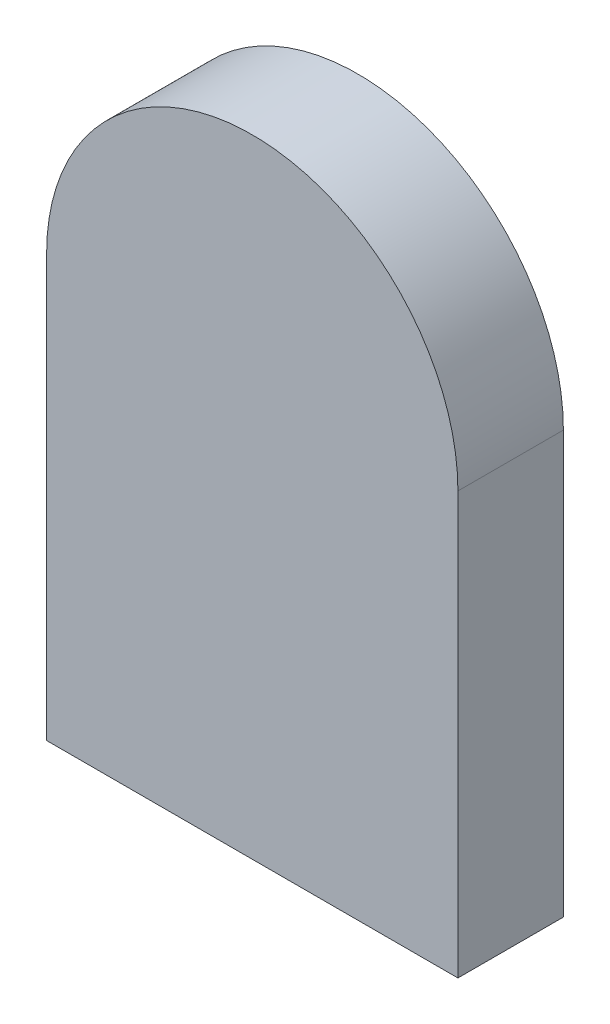
ISO-10303-21;
HEADER;
FILE_DESCRIPTION(('STEP AP214'),'2;1');
FILE_NAME('part.step','',(''),(''),'','','');
FILE_SCHEMA(('AUTOMOTIVE_DESIGN { 1 0 10303 214 1 1 1 1 }'));
ENDSEC;
DATA;
#1=APPLICATION_CONTEXT('core data for automotive mechanical design processes');
#2=APPLICATION_PROTOCOL_DEFINITION('international standard','automotive_design',2000,#1);
#3=PRODUCT_CONTEXT('',#1,'mechanical');
#4=PRODUCT('Part','Part','',(#3));
#5=PRODUCT_RELATED_PRODUCT_CATEGORY('part','',(#4));
#6=PRODUCT_DEFINITION_FORMATION('','',#4);
#7=PRODUCT_DEFINITION_CONTEXT('part definition',#1,'design');
#8=PRODUCT_DEFINITION('design','',#6,#7);
#9=PRODUCT_DEFINITION_SHAPE('','',#8);
#10=(LENGTH_UNIT() NAMED_UNIT(*) SI_UNIT(.MILLI.,.METRE.));
#11=(NAMED_UNIT(*) PLANE_ANGLE_UNIT() SI_UNIT($,.RADIAN.));
#12=(NAMED_UNIT(*) SI_UNIT($,.STERADIAN.) SOLID_ANGLE_UNIT());
#13=UNCERTAINTY_MEASURE_WITH_UNIT(LENGTH_MEASURE(1.E-05),#10,'distance_accuracy_value','');
#14=(GEOMETRIC_REPRESENTATION_CONTEXT(3) GLOBAL_UNCERTAINTY_ASSIGNED_CONTEXT((#13)) GLOBAL_UNIT_ASSIGNED_CONTEXT((#10,
#11,#12)) REPRESENTATION_CONTEXT('',''));
#15=CARTESIAN_POINT('',(0.,0.,0.));
#16=DIRECTION('',(0.,0.,1.));
#17=DIRECTION('',(1.,0.,0.));
#18=AXIS2_PLACEMENT_3D('',#15,#16,#17);
#19=CARTESIAN_POINT('',(-77.3435890798283,-6.81318919388909,1.));
#20=DIRECTION('',(-1.,0.,0.));
#21=DIRECTION('',(0.,0.,1.));
#22=AXIS2_PLACEMENT_3D('',#19,#20,#21);
#23=PLANE('',#22);
#24=DIRECTION('',(0.,1.,0.));
#25=VECTOR('',#24,1.);
#26=CARTESIAN_POINT('',(-77.3435890798283,-6.81318919388909,0.));
#27=LINE('',#26,#25);
#28=CARTESIAN_POINT('',(-77.3435890798283,-7.81318919388909,0.));
#29=VERTEX_POINT('',#28);
#30=CARTESIAN_POINT('',(-77.3435890798283,0.186810806110911,0.));
#31=VERTEX_POINT('',#30);
#32=EDGE_CURVE('E88',#29,#31,#27,.T.);
#33=ORIENTED_EDGE('',*,*,#32,.T.);
#34=DIRECTION('',(0.,0.,-1.));
#35=VECTOR('',#34,1.);
#36=CARTESIAN_POINT('',(-77.3435890798283,0.186810806110911,1.));
#37=LINE('',#36,#35);
#38=CARTESIAN_POINT('',(-77.3435890798283,0.186810806110911,1.));
#39=VERTEX_POINT('',#38);
#40=EDGE_CURVE('E11',#39,#31,#37,.T.);
#41=ORIENTED_EDGE('',*,*,#40,.F.);
#42=DIRECTION('',(0.,1.,0.));
#43=VECTOR('',#42,1.);
#44=CARTESIAN_POINT('',(-77.3435890798283,-6.81318919388909,1.));
#45=LINE('',#44,#43);
#46=CARTESIAN_POINT('',(-77.3435890798283,-7.81318919388909,1.));
#47=VERTEX_POINT('',#46);
#48=EDGE_CURVE('E145',#47,#39,#45,.T.);
#49=ORIENTED_EDGE('',*,*,#48,.F.);
#50=DIRECTION('',(0.,0.,-1.));
#51=VECTOR('',#50,1.);
#52=CARTESIAN_POINT('',(-77.3435890798283,-7.81318919388909,1.));
#53=LINE('',#52,#51);
#54=EDGE_CURVE('E51',#47,#29,#53,.T.);
#55=ORIENTED_EDGE('',*,*,#54,.T.);
#56=EDGE_LOOP('',(#33,#41,#49,#55));
#57=FACE_BOUND('',#56,.T.);
#58=ADVANCED_FACE('F33',(#57),#23,.F.);
#59=CARTESIAN_POINT('',(-74.4435890798283,0.186810806110911,1.));
#60=DIRECTION('',(0.,0.,-1.));
#61=DIRECTION('',(-1.,0.,0.));
#62=AXIS2_PLACEMENT_3D('',#59,#60,#61);
#63=CYLINDRICAL_SURFACE('',#62,2.89999999999999);
#64=CARTESIAN_POINT('',(-74.4435890798283,0.186810806110911,0.));
#65=DIRECTION('',(0.,0.,-1.));
#66=DIRECTION('',(-1.,0.,0.));
#67=AXIS2_PLACEMENT_3D('',#64,#65,#66);
#68=CIRCLE('',#67,2.89999999999999);
#69=CARTESIAN_POINT('',(-71.5435890798283,0.186810806110911,0.));
#70=VERTEX_POINT('',#69);
#71=EDGE_CURVE('E181',#31,#70,#68,.T.);
#72=ORIENTED_EDGE('',*,*,#71,.T.);
#73=DIRECTION('',(0.,0.,-1.));
#74=VECTOR('',#73,1.);
#75=CARTESIAN_POINT('',(-71.5435890798283,0.186810806110911,1.));
#76=LINE('',#75,#74);
#77=CARTESIAN_POINT('',(-71.5435890798283,0.186810806110911,1.));
#78=VERTEX_POINT('',#77);
#79=EDGE_CURVE('E42',#78,#70,#76,.T.);
#80=ORIENTED_EDGE('',*,*,#79,.F.);
#81=CARTESIAN_POINT('',(-74.4435890798283,0.186810806110911,1.));
#82=DIRECTION('',(0.,0.,-1.));
#83=DIRECTION('',(-1.,0.,0.));
#84=AXIS2_PLACEMENT_3D('',#81,#82,#83);
#85=CIRCLE('',#84,2.89999999999999);
#86=EDGE_CURVE('E141',#39,#78,#85,.T.);
#87=ORIENTED_EDGE('',*,*,#86,.F.);
#88=ORIENTED_EDGE('',*,*,#40,.T.);
#89=EDGE_LOOP('',(#72,#80,#87,#88));
#90=FACE_BOUND('',#89,.T.);
#91=ADVANCED_FACE('F195',(#90),#63,.F.);
#92=CARTESIAN_POINT('',(-71.5435890798283,-6.81318919388909,1.));
#93=DIRECTION('',(1.,0.,0.));
#94=DIRECTION('',(0.,0.,-1.));
#95=AXIS2_PLACEMENT_3D('',#92,#93,#94);
#96=PLANE('',#95);
#97=DIRECTION('',(0.,-1.,0.));
#98=VECTOR('',#97,1.);
#99=CARTESIAN_POINT('',(-71.5435890798283,-6.81318919388909,0.));
#100=LINE('',#99,#98);
#101=CARTESIAN_POINT('',(-71.5435890798283,-7.81318919388909,0.));
#102=VERTEX_POINT('',#101);
#103=EDGE_CURVE('E175',#70,#102,#100,.T.);
#104=ORIENTED_EDGE('',*,*,#103,.T.);
#105=DIRECTION('',(0.,0.,-1.));
#106=VECTOR('',#105,1.);
#107=CARTESIAN_POINT('',(-71.5435890798283,-7.81318919388909,1.));
#108=LINE('',#107,#106);
#109=CARTESIAN_POINT('',(-71.5435890798283,-7.81318919388909,1.));
#110=VERTEX_POINT('',#109);
#111=EDGE_CURVE('E118',#110,#102,#108,.T.);
#112=ORIENTED_EDGE('',*,*,#111,.F.);
#113=DIRECTION('',(0.,-1.,0.));
#114=VECTOR('',#113,1.);
#115=CARTESIAN_POINT('',(-71.5435890798283,0.186810806110911,1.));
#116=LINE('',#115,#114);
#117=EDGE_CURVE('E144',#78,#110,#116,.T.);
#118=ORIENTED_EDGE('',*,*,#117,.F.);
#119=ORIENTED_EDGE('',*,*,#79,.T.);
#120=EDGE_LOOP('',(#104,#112,#118,#119));
#121=FACE_BOUND('',#120,.T.);
#122=ADVANCED_FACE('F199',(#121),#96,.F.);
#123=CARTESIAN_POINT('',(-70.5435890798283,-7.81318919388909,1.));
#124=DIRECTION('',(-1.,0.,0.));
#125=DIRECTION('',(0.,0.,1.));
#126=AXIS2_PLACEMENT_3D('',#123,#124,#125);
#127=PLANE('',#126);
#128=DIRECTION('',(0.,1.,0.));
#129=VECTOR('',#128,1.);
#130=CARTESIAN_POINT('',(-70.5435890798283,-7.81318919388909,0.));
#131=LINE('',#130,#129);
#132=CARTESIAN_POINT('',(-70.5435890798283,-7.81318919388909,0.));
#133=VERTEX_POINT('',#132);
#134=CARTESIAN_POINT('',(-70.5435890798283,0.185713535719428,0.));
#135=VERTEX_POINT('',#134);
#136=EDGE_CURVE('E178',#133,#135,#131,.T.);
#137=ORIENTED_EDGE('',*,*,#136,.T.);
#138=DIRECTION('',(0.,0.,-1.));
#139=VECTOR('',#138,1.);
#140=CARTESIAN_POINT('',(-70.5435890798283,0.185713535719428,1.));
#141=LINE('',#140,#139);
#142=CARTESIAN_POINT('',(-70.5435890798283,0.185713535719428,2.));
#143=VERTEX_POINT('',#142);
#144=EDGE_CURVE('E119',#143,#135,#141,.T.);
#145=ORIENTED_EDGE('',*,*,#144,.F.);
#146=DIRECTION('',(0.,1.,0.));
#147=VECTOR('',#146,1.);
#148=CARTESIAN_POINT('',(-70.5435890798283,-7.81318919388909,2.));
#149=LINE('',#148,#147);
#150=CARTESIAN_POINT('',(-70.5435890798283,-7.81318919388909,2.));
#151=VERTEX_POINT('',#150);
#152=EDGE_CURVE('E122',#151,#143,#149,.T.);
#153=ORIENTED_EDGE('',*,*,#152,.F.);
#154=DIRECTION('',(0.,0.,-1.));
#155=VECTOR('',#154,1.);
#156=CARTESIAN_POINT('',(-70.5435890798283,-7.81318919388909,1.));
#157=LINE('',#156,#155);
#158=EDGE_CURVE('E107',#151,#133,#157,.T.);
#159=ORIENTED_EDGE('',*,*,#158,.T.);
#160=EDGE_LOOP('',(#137,#145,#153,#159));
#161=FACE_BOUND('',#160,.T.);
#162=ADVANCED_FACE('F123',(#161),#127,.F.);
#163=CARTESIAN_POINT('',(-74.4435890798283,0.185713535719435,1.));
#164=DIRECTION('',(0.,0.,-1.));
#165=DIRECTION('',(-1.,0.,0.));
#166=AXIS2_PLACEMENT_3D('',#163,#164,#165);
#167=CYLINDRICAL_SURFACE('',#166,3.9);
#168=CARTESIAN_POINT('',(-74.4435890798283,0.185713535719435,0.));
#169=DIRECTION('',(0.,0.,1.));
#170=DIRECTION('',(-1.,0.,0.));
#171=AXIS2_PLACEMENT_3D('',#168,#169,#170);
#172=CIRCLE('',#171,3.9);
#173=CARTESIAN_POINT('',(-78.3435890798283,0.185713535719428,0.));
#174=VERTEX_POINT('',#173);
#175=EDGE_CURVE('E163',#135,#174,#172,.T.);
#176=ORIENTED_EDGE('',*,*,#175,.T.);
#177=DIRECTION('',(0.,0.,-1.));
#178=VECTOR('',#177,1.);
#179=CARTESIAN_POINT('',(-78.3435890798283,0.185713535719428,1.));
#180=LINE('',#179,#178);
#181=CARTESIAN_POINT('',(-78.3435890798283,0.185713535719428,2.));
#182=VERTEX_POINT('',#181);
#183=EDGE_CURVE('E168',#182,#174,#180,.T.);
#184=ORIENTED_EDGE('',*,*,#183,.F.);
#185=CARTESIAN_POINT('',(-74.4435890798283,0.185713535719425,2.));
#186=DIRECTION('',(0.,0.,1.));
#187=DIRECTION('',(-1.,0.,0.));
#188=AXIS2_PLACEMENT_3D('',#185,#186,#187);
#189=CIRCLE('',#188,3.9);
#190=EDGE_CURVE('E128',#143,#182,#189,.T.);
#191=ORIENTED_EDGE('',*,*,#190,.F.);
#192=ORIENTED_EDGE('',*,*,#144,.T.);
#193=EDGE_LOOP('',(#176,#184,#191,#192));
#194=FACE_BOUND('',#193,.T.);
#195=ADVANCED_FACE('F184',(#194),#167,.T.);
#196=CARTESIAN_POINT('',(-78.3435890798283,0.185713535719428,1.));
#197=DIRECTION('',(1.,0.,0.));
#198=DIRECTION('',(0.,0.,-1.));
#199=AXIS2_PLACEMENT_3D('',#196,#197,#198);
#200=PLANE('',#199);
#201=DIRECTION('',(0.,-1.,0.));
#202=VECTOR('',#201,1.);
#203=CARTESIAN_POINT('',(-78.3435890798283,0.185713535719428,0.));
#204=LINE('',#203,#202);
#205=CARTESIAN_POINT('',(-78.3435890798283,-7.81318919388909,0.));
#206=VERTEX_POINT('',#205);
#207=EDGE_CURVE('E82',#174,#206,#204,.T.);
#208=ORIENTED_EDGE('',*,*,#207,.T.);
#209=DIRECTION('',(0.,0.,-1.));
#210=VECTOR('',#209,1.);
#211=CARTESIAN_POINT('',(-78.3435890798283,-7.81318919388909,1.));
#212=LINE('',#211,#210);
#213=CARTESIAN_POINT('',(-78.3435890798283,-7.81318919388909,2.));
#214=VERTEX_POINT('',#213);
#215=EDGE_CURVE('E156',#214,#206,#212,.T.);
#216=ORIENTED_EDGE('',*,*,#215,.F.);
#217=DIRECTION('',(0.,-1.,0.));
#218=VECTOR('',#217,1.);
#219=CARTESIAN_POINT('',(-78.3435890798283,-7.81318919388909,2.));
#220=LINE('',#219,#218);
#221=EDGE_CURVE('E132',#182,#214,#220,.T.);
#222=ORIENTED_EDGE('',*,*,#221,.F.);
#223=ORIENTED_EDGE('',*,*,#183,.T.);
#224=EDGE_LOOP('',(#208,#216,#222,#223));
#225=FACE_BOUND('',#224,.T.);
#226=ADVANCED_FACE('F185',(#225),#200,.F.);
#227=CARTESIAN_POINT('',(-77.3435890798283,-7.81318919388909,1.));
#228=DIRECTION('',(0.,1.,0.));
#229=DIRECTION('',(0.,0.,1.));
#230=AXIS2_PLACEMENT_3D('',#227,#228,#229);
#231=PLANE('',#230);
#232=DIRECTION('',(1.,0.,0.));
#233=VECTOR('',#232,1.);
#234=CARTESIAN_POINT('',(-77.3435890798283,-7.81318919388909,0.));
#235=LINE('',#234,#233);
#236=EDGE_CURVE('E159',#206,#29,#235,.T.);
#237=ORIENTED_EDGE('',*,*,#236,.T.);
#238=ORIENTED_EDGE('',*,*,#54,.F.);
#239=DIRECTION('',(1.,0.,0.));
#240=VECTOR('',#239,1.);
#241=CARTESIAN_POINT('',(-77.3435890798283,-7.81318919388909,1.));
#242=LINE('',#241,#240);
#243=EDGE_CURVE('E133',#47,#110,#242,.T.);
#244=ORIENTED_EDGE('',*,*,#243,.T.);
#245=ORIENTED_EDGE('',*,*,#111,.T.);
#246=DIRECTION('',(1.,0.,0.));
#247=VECTOR('',#246,1.);
#248=CARTESIAN_POINT('',(-71.5435890798283,-7.81318919388909,0.));
#249=LINE('',#248,#247);
#250=EDGE_CURVE('E115',#102,#133,#249,.T.);
#251=ORIENTED_EDGE('',*,*,#250,.T.);
#252=ORIENTED_EDGE('',*,*,#158,.F.);
#253=DIRECTION('',(1.,0.,0.));
#254=VECTOR('',#253,1.);
#255=CARTESIAN_POINT('',(-70.5435890798283,-7.81318919388909,2.));
#256=LINE('',#255,#254);
#257=EDGE_CURVE('E111',#214,#151,#256,.T.);
#258=ORIENTED_EDGE('',*,*,#257,.F.);
#259=ORIENTED_EDGE('',*,*,#215,.T.);
#260=EDGE_LOOP('',(#237,#238,#244,#245,#251,#252,#258,#259));
#261=FACE_BOUND('',#260,.T.);
#262=ADVANCED_FACE('F109',(#261),#231,.F.);
#263=CARTESIAN_POINT('',(-74.4435890798283,0.185713535719435,0.));
#264=DIRECTION('',(0.,0.,-1.));
#265=DIRECTION('',(-1.,0.,0.));
#266=AXIS2_PLACEMENT_3D('',#263,#264,#265);
#267=PLANE('',#266);
#268=ORIENTED_EDGE('',*,*,#32,.F.);
#269=ORIENTED_EDGE('',*,*,#236,.F.);
#270=ORIENTED_EDGE('',*,*,#207,.F.);
#271=ORIENTED_EDGE('',*,*,#175,.F.);
#272=ORIENTED_EDGE('',*,*,#136,.F.);
#273=ORIENTED_EDGE('',*,*,#250,.F.);
#274=ORIENTED_EDGE('',*,*,#103,.F.);
#275=ORIENTED_EDGE('',*,*,#71,.F.);
#276=EDGE_LOOP('',(#268,#269,#270,#271,#272,#273,#274,#275));
#277=FACE_BOUND('',#276,.T.);
#278=ADVANCED_FACE('F174',(#277),#267,.T.);
#279=CARTESIAN_POINT('',(-74.4435890798283,0.185713535719425,2.));
#280=DIRECTION('',(0.,0.,-1.));
#281=DIRECTION('',(-1.,0.,0.));
#282=AXIS2_PLACEMENT_3D('',#279,#280,#281);
#283=PLANE('',#282);
#284=ORIENTED_EDGE('',*,*,#257,.T.);
#285=ORIENTED_EDGE('',*,*,#152,.T.);
#286=ORIENTED_EDGE('',*,*,#190,.T.);
#287=ORIENTED_EDGE('',*,*,#221,.T.);
#288=EDGE_LOOP('',(#284,#285,#286,#287));
#289=FACE_BOUND('',#288,.T.);
#290=ADVANCED_FACE('F130',(#289),#283,.F.);
#291=CARTESIAN_POINT('',(-74.4435890798283,0.185713535719425,1.));
#292=DIRECTION('',(0.,0.,-1.));
#293=DIRECTION('',(-1.,0.,0.));
#294=AXIS2_PLACEMENT_3D('',#291,#292,#293);
#295=PLANE('',#294);
#296=ORIENTED_EDGE('',*,*,#243,.F.);
#297=ORIENTED_EDGE('',*,*,#48,.T.);
#298=ORIENTED_EDGE('',*,*,#86,.T.);
#299=ORIENTED_EDGE('',*,*,#117,.T.);
#300=EDGE_LOOP('',(#296,#297,#298,#299));
#301=FACE_BOUND('',#300,.T.);
#302=ADVANCED_FACE('F201',(#301),#295,.T.);
#303=CLOSED_SHELL('',(#58,#91,#122,#162,#195,#226,#262,#278,#290,#302));
#304=MANIFOLD_SOLID_BREP('B2',#303);
#305=ADVANCED_BREP_SHAPE_REPRESENTATION('',(#18,#304),#14);
#306=SHAPE_DEFINITION_REPRESENTATION(#9,#305);
ENDSEC;
END-ISO-10303-21;
